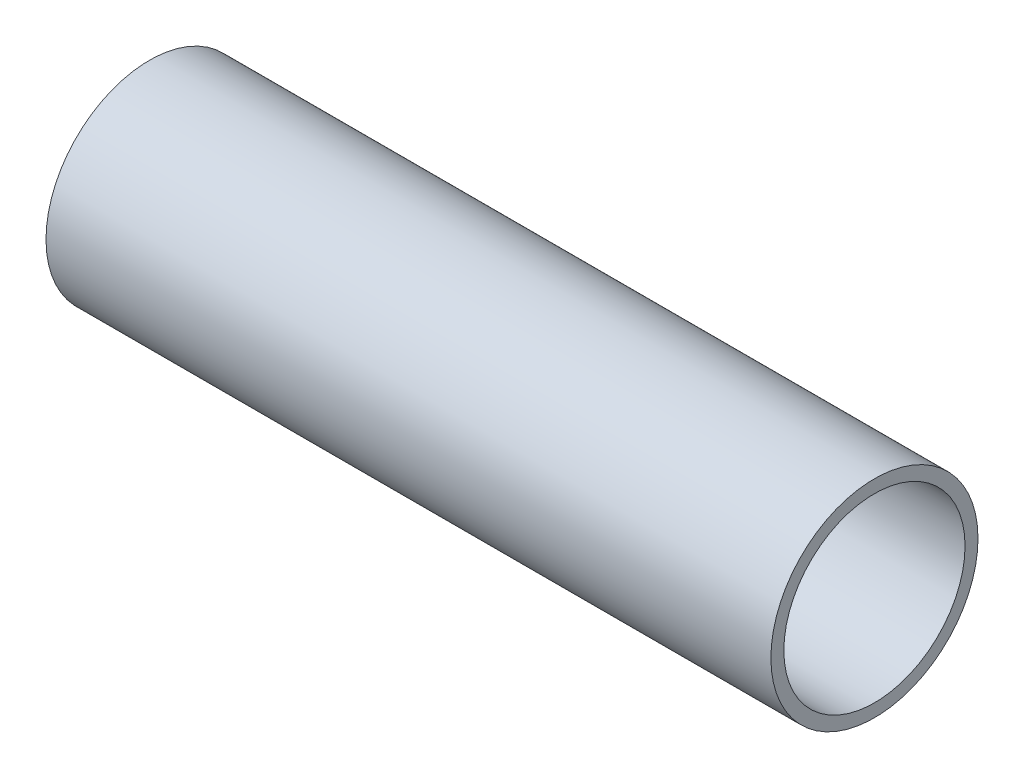
ISO-10303-21;
HEADER;
FILE_DESCRIPTION(('STEP AP214'),'2;1');
FILE_NAME('part.step','',(''),(''),'','','');
FILE_SCHEMA(('AUTOMOTIVE_DESIGN { 1 0 10303 214 1 1 1 1 }'));
ENDSEC;
DATA;
#1=APPLICATION_CONTEXT('core data for automotive mechanical design processes');
#2=APPLICATION_PROTOCOL_DEFINITION('international standard','automotive_design',2000,#1);
#3=PRODUCT_CONTEXT('',#1,'mechanical');
#4=PRODUCT('Part','Part','',(#3));
#5=PRODUCT_RELATED_PRODUCT_CATEGORY('part','',(#4));
#6=PRODUCT_DEFINITION_FORMATION('','',#4);
#7=PRODUCT_DEFINITION_CONTEXT('part definition',#1,'design');
#8=PRODUCT_DEFINITION('design','',#6,#7);
#9=PRODUCT_DEFINITION_SHAPE('','',#8);
#10=(LENGTH_UNIT() NAMED_UNIT(*) SI_UNIT(.MILLI.,.METRE.));
#11=(NAMED_UNIT(*) PLANE_ANGLE_UNIT() SI_UNIT($,.RADIAN.));
#12=(NAMED_UNIT(*) SI_UNIT($,.STERADIAN.) SOLID_ANGLE_UNIT());
#13=UNCERTAINTY_MEASURE_WITH_UNIT(LENGTH_MEASURE(1.E-05),#10,'distance_accuracy_value','');
#14=(GEOMETRIC_REPRESENTATION_CONTEXT(3) GLOBAL_UNCERTAINTY_ASSIGNED_CONTEXT((#13)) GLOBAL_UNIT_ASSIGNED_CONTEXT((#10,
#11,#12)) REPRESENTATION_CONTEXT('',''));
#15=CARTESIAN_POINT('',(0.,0.,0.));
#16=DIRECTION('',(0.,0.,1.));
#17=DIRECTION('',(1.,0.,0.));
#18=AXIS2_PLACEMENT_3D('',#15,#16,#17);
#19=CARTESIAN_POINT('',(177.8,0.,0.));
#20=DIRECTION('',(1.,0.,0.));
#21=DIRECTION('',(0.,0.,-1.));
#22=AXIS2_PLACEMENT_3D('',#19,#20,#21);
#23=PLANE('',#22);
#24=CARTESIAN_POINT('',(177.8,0.,0.));
#25=DIRECTION('',(1.,0.,0.));
#26=DIRECTION('',(0.,0.,-1.));
#27=AXIS2_PLACEMENT_3D('',#24,#25,#26);
#28=CIRCLE('',#27,25.4);
#29=CARTESIAN_POINT('',(177.8,0.,-25.4));
#30=VERTEX_POINT('',#29);
#31=EDGE_CURVE('E10',#30,#30,#28,.T.);
#32=ORIENTED_EDGE('',*,*,#31,.T.);
#33=EDGE_LOOP('',(#32));
#34=FACE_BOUND('',#33,.T.);
#35=CARTESIAN_POINT('',(177.8,0.,0.));
#36=DIRECTION('',(1.,0.,0.));
#37=DIRECTION('',(0.,0.,-1.));
#38=AXIS2_PLACEMENT_3D('',#35,#36,#37);
#39=CIRCLE('',#38,22.225);
#40=CARTESIAN_POINT('',(177.8,0.,-22.225));
#41=VERTEX_POINT('',#40);
#42=EDGE_CURVE('E43',#41,#41,#39,.T.);
#43=ORIENTED_EDGE('',*,*,#42,.F.);
#44=EDGE_LOOP('',(#43));
#45=FACE_BOUND('',#44,.T.);
#46=ADVANCED_FACE('F32',(#34,#45),#23,.T.);
#47=CARTESIAN_POINT('',(0.,0.,0.));
#48=DIRECTION('',(1.,0.,0.));
#49=DIRECTION('',(0.,0.,-1.));
#50=AXIS2_PLACEMENT_3D('',#47,#48,#49);
#51=PLANE('',#50);
#52=CARTESIAN_POINT('',(0.,0.,0.));
#53=DIRECTION('',(1.,0.,0.));
#54=DIRECTION('',(0.,0.,-1.));
#55=AXIS2_PLACEMENT_3D('',#52,#53,#54);
#56=CIRCLE('',#55,25.4);
#57=CARTESIAN_POINT('',(0.,0.,-25.4));
#58=VERTEX_POINT('',#57);
#59=EDGE_CURVE('E36',#58,#58,#56,.T.);
#60=ORIENTED_EDGE('',*,*,#59,.F.);
#61=EDGE_LOOP('',(#60));
#62=FACE_BOUND('',#61,.T.);
#63=CARTESIAN_POINT('',(0.,0.,0.));
#64=DIRECTION('',(1.,0.,0.));
#65=DIRECTION('',(0.,0.,-1.));
#66=AXIS2_PLACEMENT_3D('',#63,#64,#65);
#67=CIRCLE('',#66,22.225);
#68=CARTESIAN_POINT('',(0.,0.,-22.225));
#69=VERTEX_POINT('',#68);
#70=EDGE_CURVE('E45',#69,#69,#67,.T.);
#71=ORIENTED_EDGE('',*,*,#70,.T.);
#72=EDGE_LOOP('',(#71));
#73=FACE_BOUND('',#72,.T.);
#74=ADVANCED_FACE('F55',(#62,#73),#51,.F.);
#75=CARTESIAN_POINT('',(177.8,0.,0.));
#76=DIRECTION('',(-1.,0.,0.));
#77=DIRECTION('',(0.,0.,1.));
#78=AXIS2_PLACEMENT_3D('',#75,#76,#77);
#79=CYLINDRICAL_SURFACE('',#78,25.4);
#80=ORIENTED_EDGE('',*,*,#31,.F.);
#81=EDGE_LOOP('',(#80));
#82=FACE_BOUND('',#81,.T.);
#83=ORIENTED_EDGE('',*,*,#59,.T.);
#84=EDGE_LOOP('',(#83));
#85=FACE_BOUND('',#84,.T.);
#86=ADVANCED_FACE('F34',(#82,#85),#79,.T.);
#87=CARTESIAN_POINT('',(177.8,0.,0.));
#88=DIRECTION('',(-1.,0.,0.));
#89=DIRECTION('',(0.,0.,1.));
#90=AXIS2_PLACEMENT_3D('',#87,#88,#89);
#91=CYLINDRICAL_SURFACE('',#90,22.225);
#92=ORIENTED_EDGE('',*,*,#42,.T.);
#93=EDGE_LOOP('',(#92));
#94=FACE_BOUND('',#93,.T.);
#95=ORIENTED_EDGE('',*,*,#70,.F.);
#96=EDGE_LOOP('',(#95));
#97=FACE_BOUND('',#96,.T.);
#98=ADVANCED_FACE('F51',(#94,#97),#91,.F.);
#99=CLOSED_SHELL('',(#46,#74,#86,#98));
#100=MANIFOLD_SOLID_BREP('B2',#99);
#101=ADVANCED_BREP_SHAPE_REPRESENTATION('',(#18,#100),#14);
#102=SHAPE_DEFINITION_REPRESENTATION(#9,#101);
ENDSEC;
END-ISO-10303-21;
